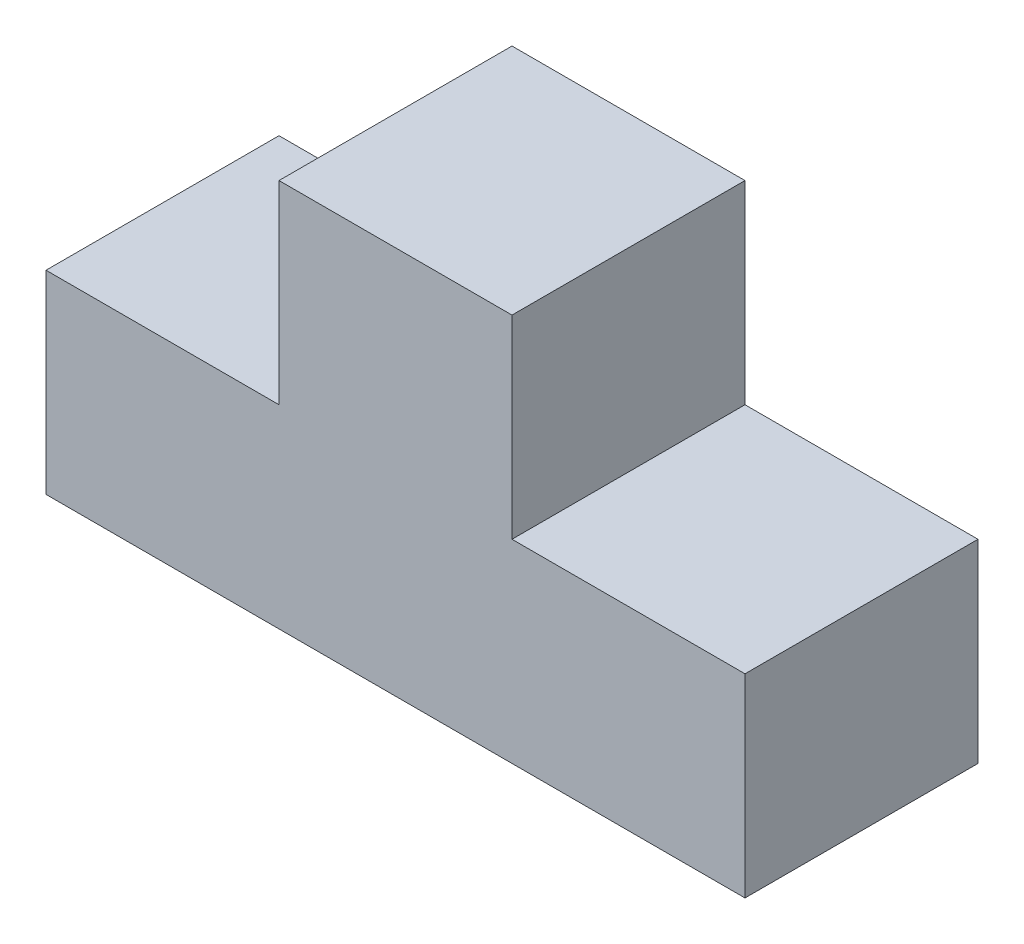
ISO-10303-21;
HEADER;
FILE_DESCRIPTION(('STEP AP214'),'2;1');
FILE_NAME('part.step','',(''),(''),'','','');
FILE_SCHEMA(('AUTOMOTIVE_DESIGN { 1 0 10303 214 1 1 1 1 }'));
ENDSEC;
DATA;
#1=APPLICATION_CONTEXT('core data for automotive mechanical design processes');
#2=APPLICATION_PROTOCOL_DEFINITION('international standard','automotive_design',2000,#1);
#3=PRODUCT_CONTEXT('',#1,'mechanical');
#4=PRODUCT('Part','Part','',(#3));
#5=PRODUCT_RELATED_PRODUCT_CATEGORY('part','',(#4));
#6=PRODUCT_DEFINITION_FORMATION('','',#4);
#7=PRODUCT_DEFINITION_CONTEXT('part definition',#1,'design');
#8=PRODUCT_DEFINITION('design','',#6,#7);
#9=PRODUCT_DEFINITION_SHAPE('','',#8);
#10=(LENGTH_UNIT() NAMED_UNIT(*) SI_UNIT(.MILLI.,.METRE.));
#11=(NAMED_UNIT(*) PLANE_ANGLE_UNIT() SI_UNIT($,.RADIAN.));
#12=(NAMED_UNIT(*) SI_UNIT($,.STERADIAN.) SOLID_ANGLE_UNIT());
#13=UNCERTAINTY_MEASURE_WITH_UNIT(LENGTH_MEASURE(1.E-05),#10,'distance_accuracy_value','');
#14=(GEOMETRIC_REPRESENTATION_CONTEXT(3) GLOBAL_UNCERTAINTY_ASSIGNED_CONTEXT((#13)) GLOBAL_UNIT_ASSIGNED_CONTEXT((#10,
#11,#12)) REPRESENTATION_CONTEXT('',''));
#15=CARTESIAN_POINT('',(0.,0.,0.));
#16=DIRECTION('',(0.,0.,1.));
#17=DIRECTION('',(1.,0.,0.));
#18=AXIS2_PLACEMENT_3D('',#15,#16,#17);
#19=CARTESIAN_POINT('',(45.,0.,30.));
#20=DIRECTION('',(-1.,0.,0.));
#21=DIRECTION('',(0.,0.,1.));
#22=AXIS2_PLACEMENT_3D('',#19,#20,#21);
#23=PLANE('',#22);
#24=DIRECTION('',(0.,1.,0.));
#25=VECTOR('',#24,1.);
#26=CARTESIAN_POINT('',(45.,0.,0.));
#27=LINE('',#26,#25);
#28=CARTESIAN_POINT('',(45.,0.,0.));
#29=VERTEX_POINT('',#28);
#30=CARTESIAN_POINT('',(45.,25.,0.));
#31=VERTEX_POINT('',#30);
#32=EDGE_CURVE('E131',#29,#31,#27,.T.);
#33=ORIENTED_EDGE('',*,*,#32,.T.);
#34=DIRECTION('',(0.,0.,-1.));
#35=VECTOR('',#34,1.);
#36=CARTESIAN_POINT('',(45.,25.,30.));
#37=LINE('',#36,#35);
#38=CARTESIAN_POINT('',(45.,25.,30.));
#39=VERTEX_POINT('',#38);
#40=EDGE_CURVE('E11',#39,#31,#37,.T.);
#41=ORIENTED_EDGE('',*,*,#40,.F.);
#42=DIRECTION('',(0.,1.,0.));
#43=VECTOR('',#42,1.);
#44=CARTESIAN_POINT('',(45.,0.,30.));
#45=LINE('',#44,#43);
#46=CARTESIAN_POINT('',(45.,0.,30.));
#47=VERTEX_POINT('',#46);
#48=EDGE_CURVE('E145',#47,#39,#45,.T.);
#49=ORIENTED_EDGE('',*,*,#48,.F.);
#50=DIRECTION('',(0.,0.,-1.));
#51=VECTOR('',#50,1.);
#52=CARTESIAN_POINT('',(45.,0.,30.));
#53=LINE('',#52,#51);
#54=EDGE_CURVE('E127',#47,#29,#53,.T.);
#55=ORIENTED_EDGE('',*,*,#54,.T.);
#56=EDGE_LOOP('',(#33,#41,#49,#55));
#57=FACE_BOUND('',#56,.T.);
#58=ADVANCED_FACE('F35',(#57),#23,.F.);
#59=CARTESIAN_POINT('',(45.,25.,30.));
#60=DIRECTION('',(0.,-1.,0.));
#61=DIRECTION('',(1.,0.,0.));
#62=AXIS2_PLACEMENT_3D('',#59,#60,#61);
#63=PLANE('',#62);
#64=DIRECTION('',(-1.,0.,0.));
#65=VECTOR('',#64,1.);
#66=CARTESIAN_POINT('',(45.,25.,0.));
#67=LINE('',#66,#65);
#68=CARTESIAN_POINT('',(15.,25.,0.));
#69=VERTEX_POINT('',#68);
#70=EDGE_CURVE('E134',#31,#69,#67,.T.);
#71=ORIENTED_EDGE('',*,*,#70,.T.);
#72=DIRECTION('',(0.,0.,-1.));
#73=VECTOR('',#72,1.);
#74=CARTESIAN_POINT('',(15.,25.,30.));
#75=LINE('',#74,#73);
#76=CARTESIAN_POINT('',(15.,25.,30.));
#77=VERTEX_POINT('',#76);
#78=EDGE_CURVE('E43',#77,#69,#75,.T.);
#79=ORIENTED_EDGE('',*,*,#78,.F.);
#80=DIRECTION('',(-1.,0.,0.));
#81=VECTOR('',#80,1.);
#82=CARTESIAN_POINT('',(45.,25.,30.));
#83=LINE('',#82,#81);
#84=EDGE_CURVE('E94',#39,#77,#83,.T.);
#85=ORIENTED_EDGE('',*,*,#84,.F.);
#86=ORIENTED_EDGE('',*,*,#40,.T.);
#87=EDGE_LOOP('',(#71,#79,#85,#86));
#88=FACE_BOUND('',#87,.T.);
#89=ADVANCED_FACE('F180',(#88),#63,.F.);
#90=CARTESIAN_POINT('',(15.,25.,30.));
#91=DIRECTION('',(-1.,0.,0.));
#92=DIRECTION('',(0.,-1.,0.));
#93=AXIS2_PLACEMENT_3D('',#90,#91,#92);
#94=PLANE('',#93);
#95=DIRECTION('',(0.,1.,0.));
#96=VECTOR('',#95,1.);
#97=CARTESIAN_POINT('',(15.,25.,0.));
#98=LINE('',#97,#96);
#99=CARTESIAN_POINT('',(15.,50.,0.));
#100=VERTEX_POINT('',#99);
#101=EDGE_CURVE('E136',#69,#100,#98,.T.);
#102=ORIENTED_EDGE('',*,*,#101,.T.);
#103=DIRECTION('',(0.,0.,-1.));
#104=VECTOR('',#103,1.);
#105=CARTESIAN_POINT('',(15.,50.,30.));
#106=LINE('',#105,#104);
#107=CARTESIAN_POINT('',(15.,50.,30.));
#108=VERTEX_POINT('',#107);
#109=EDGE_CURVE('E152',#108,#100,#106,.T.);
#110=ORIENTED_EDGE('',*,*,#109,.F.);
#111=DIRECTION('',(0.,1.,0.));
#112=VECTOR('',#111,1.);
#113=CARTESIAN_POINT('',(15.,25.,30.));
#114=LINE('',#113,#112);
#115=EDGE_CURVE('E160',#77,#108,#114,.T.);
#116=ORIENTED_EDGE('',*,*,#115,.F.);
#117=ORIENTED_EDGE('',*,*,#78,.T.);
#118=EDGE_LOOP('',(#102,#110,#116,#117));
#119=FACE_BOUND('',#118,.T.);
#120=ADVANCED_FACE('F158',(#119),#94,.F.);
#121=CARTESIAN_POINT('',(15.,50.,30.));
#122=DIRECTION('',(0.,-1.,0.));
#123=DIRECTION('',(1.,0.,0.));
#124=AXIS2_PLACEMENT_3D('',#121,#122,#123);
#125=PLANE('',#124);
#126=DIRECTION('',(-1.,0.,0.));
#127=VECTOR('',#126,1.);
#128=CARTESIAN_POINT('',(15.,50.,0.));
#129=LINE('',#128,#127);
#130=CARTESIAN_POINT('',(-15.,50.,0.));
#131=VERTEX_POINT('',#130);
#132=EDGE_CURVE('E138',#100,#131,#129,.T.);
#133=ORIENTED_EDGE('',*,*,#132,.T.);
#134=DIRECTION('',(0.,0.,-1.));
#135=VECTOR('',#134,1.);
#136=CARTESIAN_POINT('',(-15.,50.,30.));
#137=LINE('',#136,#135);
#138=CARTESIAN_POINT('',(-15.,50.,30.));
#139=VERTEX_POINT('',#138);
#140=EDGE_CURVE('E149',#139,#131,#137,.T.);
#141=ORIENTED_EDGE('',*,*,#140,.F.);
#142=DIRECTION('',(-1.,0.,0.));
#143=VECTOR('',#142,1.);
#144=CARTESIAN_POINT('',(15.,50.,30.));
#145=LINE('',#144,#143);
#146=EDGE_CURVE('E172',#108,#139,#145,.T.);
#147=ORIENTED_EDGE('',*,*,#146,.F.);
#148=ORIENTED_EDGE('',*,*,#109,.T.);
#149=EDGE_LOOP('',(#133,#141,#147,#148));
#150=FACE_BOUND('',#149,.T.);
#151=ADVANCED_FACE('F168',(#150),#125,.F.);
#152=CARTESIAN_POINT('',(-15.,25.,30.));
#153=DIRECTION('',(1.,0.,0.));
#154=DIRECTION('',(0.,1.,0.));
#155=AXIS2_PLACEMENT_3D('',#152,#153,#154);
#156=PLANE('',#155);
#157=DIRECTION('',(0.,-1.,0.));
#158=VECTOR('',#157,1.);
#159=CARTESIAN_POINT('',(-15.,25.,0.));
#160=LINE('',#159,#158);
#161=CARTESIAN_POINT('',(-15.,25.,0.));
#162=VERTEX_POINT('',#161);
#163=EDGE_CURVE('E140',#131,#162,#160,.T.);
#164=ORIENTED_EDGE('',*,*,#163,.T.);
#165=DIRECTION('',(0.,0.,-1.));
#166=VECTOR('',#165,1.);
#167=CARTESIAN_POINT('',(-15.,25.,30.));
#168=LINE('',#167,#166);
#169=CARTESIAN_POINT('',(-15.,25.,30.));
#170=VERTEX_POINT('',#169);
#171=EDGE_CURVE('E122',#170,#162,#168,.T.);
#172=ORIENTED_EDGE('',*,*,#171,.F.);
#173=DIRECTION('',(0.,-1.,0.));
#174=VECTOR('',#173,1.);
#175=CARTESIAN_POINT('',(-15.,25.,30.));
#176=LINE('',#175,#174);
#177=EDGE_CURVE('E113',#139,#170,#176,.T.);
#178=ORIENTED_EDGE('',*,*,#177,.F.);
#179=ORIENTED_EDGE('',*,*,#140,.T.);
#180=EDGE_LOOP('',(#164,#172,#178,#179));
#181=FACE_BOUND('',#180,.T.);
#182=ADVANCED_FACE('F171',(#181),#156,.F.);
#183=CARTESIAN_POINT('',(-45.,25.,30.));
#184=DIRECTION('',(0.,-1.,0.));
#185=DIRECTION('',(1.,0.,0.));
#186=AXIS2_PLACEMENT_3D('',#183,#184,#185);
#187=PLANE('',#186);
#188=DIRECTION('',(-1.,0.,0.));
#189=VECTOR('',#188,1.);
#190=CARTESIAN_POINT('',(-45.,25.,0.));
#191=LINE('',#190,#189);
#192=CARTESIAN_POINT('',(-45.,25.,0.));
#193=VERTEX_POINT('',#192);
#194=EDGE_CURVE('E121',#162,#193,#191,.T.);
#195=ORIENTED_EDGE('',*,*,#194,.T.);
#196=DIRECTION('',(0.,0.,-1.));
#197=VECTOR('',#196,1.);
#198=CARTESIAN_POINT('',(-45.,25.,30.));
#199=LINE('',#198,#197);
#200=CARTESIAN_POINT('',(-45.,25.,30.));
#201=VERTEX_POINT('',#200);
#202=EDGE_CURVE('E118',#201,#193,#199,.T.);
#203=ORIENTED_EDGE('',*,*,#202,.F.);
#204=DIRECTION('',(-1.,0.,0.));
#205=VECTOR('',#204,1.);
#206=CARTESIAN_POINT('',(-45.,25.,30.));
#207=LINE('',#206,#205);
#208=EDGE_CURVE('E107',#170,#201,#207,.T.);
#209=ORIENTED_EDGE('',*,*,#208,.F.);
#210=ORIENTED_EDGE('',*,*,#171,.T.);
#211=EDGE_LOOP('',(#195,#203,#209,#210));
#212=FACE_BOUND('',#211,.T.);
#213=ADVANCED_FACE('F119',(#212),#187,.F.);
#214=CARTESIAN_POINT('',(-45.,0.,30.));
#215=DIRECTION('',(1.,0.,0.));
#216=DIRECTION('',(0.,0.,-1.));
#217=AXIS2_PLACEMENT_3D('',#214,#215,#216);
#218=PLANE('',#217);
#219=DIRECTION('',(0.,-1.,0.));
#220=VECTOR('',#219,1.);
#221=CARTESIAN_POINT('',(-45.,0.,0.));
#222=LINE('',#221,#220);
#223=CARTESIAN_POINT('',(-45.,0.,0.));
#224=VERTEX_POINT('',#223);
#225=EDGE_CURVE('E80',#193,#224,#222,.T.);
#226=ORIENTED_EDGE('',*,*,#225,.T.);
#227=DIRECTION('',(0.,0.,-1.));
#228=VECTOR('',#227,1.);
#229=CARTESIAN_POINT('',(-45.,0.,30.));
#230=LINE('',#229,#228);
#231=CARTESIAN_POINT('',(-45.,0.,30.));
#232=VERTEX_POINT('',#231);
#233=EDGE_CURVE('E123',#232,#224,#230,.T.);
#234=ORIENTED_EDGE('',*,*,#233,.F.);
#235=DIRECTION('',(0.,-1.,0.));
#236=VECTOR('',#235,1.);
#237=CARTESIAN_POINT('',(-45.,0.,30.));
#238=LINE('',#237,#236);
#239=EDGE_CURVE('E111',#201,#232,#238,.T.);
#240=ORIENTED_EDGE('',*,*,#239,.F.);
#241=ORIENTED_EDGE('',*,*,#202,.T.);
#242=EDGE_LOOP('',(#226,#234,#240,#241));
#243=FACE_BOUND('',#242,.T.);
#244=ADVANCED_FACE('F125',(#243),#218,.F.);
#245=CARTESIAN_POINT('',(-45.,0.,30.));
#246=DIRECTION('',(0.,1.,0.));
#247=DIRECTION('',(0.,0.,1.));
#248=AXIS2_PLACEMENT_3D('',#245,#246,#247);
#249=PLANE('',#248);
#250=DIRECTION('',(1.,0.,0.));
#251=VECTOR('',#250,1.);
#252=CARTESIAN_POINT('',(-45.,0.,0.));
#253=LINE('',#252,#251);
#254=EDGE_CURVE('E86',#224,#29,#253,.T.);
#255=ORIENTED_EDGE('',*,*,#254,.T.);
#256=ORIENTED_EDGE('',*,*,#54,.F.);
#257=DIRECTION('',(1.,0.,0.));
#258=VECTOR('',#257,1.);
#259=CARTESIAN_POINT('',(-45.,0.,30.));
#260=LINE('',#259,#258);
#261=EDGE_CURVE('E51',#232,#47,#260,.T.);
#262=ORIENTED_EDGE('',*,*,#261,.F.);
#263=ORIENTED_EDGE('',*,*,#233,.T.);
#264=EDGE_LOOP('',(#255,#256,#262,#263));
#265=FACE_BOUND('',#264,.T.);
#266=ADVANCED_FACE('F196',(#265),#249,.F.);
#267=CARTESIAN_POINT('',(0.,0.,30.));
#268=DIRECTION('',(0.,0.,1.));
#269=DIRECTION('',(1.,0.,0.));
#270=AXIS2_PLACEMENT_3D('',#267,#268,#269);
#271=PLANE('',#270);
#272=ORIENTED_EDGE('',*,*,#48,.T.);
#273=ORIENTED_EDGE('',*,*,#84,.T.);
#274=ORIENTED_EDGE('',*,*,#115,.T.);
#275=ORIENTED_EDGE('',*,*,#146,.T.);
#276=ORIENTED_EDGE('',*,*,#177,.T.);
#277=ORIENTED_EDGE('',*,*,#208,.T.);
#278=ORIENTED_EDGE('',*,*,#239,.T.);
#279=ORIENTED_EDGE('',*,*,#261,.T.);
#280=EDGE_LOOP('',(#272,#273,#274,#275,#276,#277,#278,#279));
#281=FACE_BOUND('',#280,.T.);
#282=ADVANCED_FACE('F109',(#281),#271,.T.);
#283=CARTESIAN_POINT('',(0.,0.,0.));
#284=DIRECTION('',(0.,0.,1.));
#285=DIRECTION('',(1.,0.,0.));
#286=AXIS2_PLACEMENT_3D('',#283,#284,#285);
#287=PLANE('',#286);
#288=ORIENTED_EDGE('',*,*,#32,.F.);
#289=ORIENTED_EDGE('',*,*,#254,.F.);
#290=ORIENTED_EDGE('',*,*,#225,.F.);
#291=ORIENTED_EDGE('',*,*,#194,.F.);
#292=ORIENTED_EDGE('',*,*,#163,.F.);
#293=ORIENTED_EDGE('',*,*,#132,.F.);
#294=ORIENTED_EDGE('',*,*,#101,.F.);
#295=ORIENTED_EDGE('',*,*,#70,.F.);
#296=EDGE_LOOP('',(#288,#289,#290,#291,#292,#293,#294,#295));
#297=FACE_BOUND('',#296,.T.);
#298=ADVANCED_FACE('F164',(#297),#287,.F.);
#299=CLOSED_SHELL('',(#58,#89,#120,#151,#182,#213,#244,#266,#282,#298));
#300=MANIFOLD_SOLID_BREP('B2',#299);
#301=ADVANCED_BREP_SHAPE_REPRESENTATION('',(#18,#300),#14);
#302=SHAPE_DEFINITION_REPRESENTATION(#9,#301);
ENDSEC;
END-ISO-10303-21;
